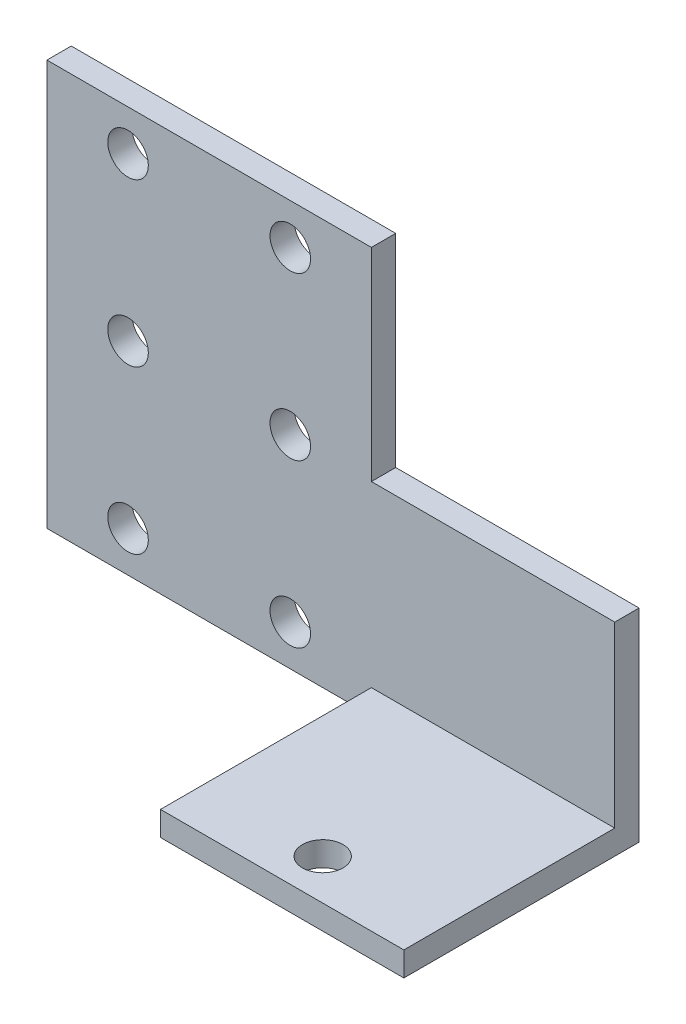
ISO-10303-21;
HEADER;
FILE_DESCRIPTION(('STEP AP214'),'2;1');
FILE_NAME('part.step','',(''),(''),'','','');
FILE_SCHEMA(('AUTOMOTIVE_DESIGN { 1 0 10303 214 1 1 1 1 }'));
ENDSEC;
DATA;
#1=APPLICATION_CONTEXT('core data for automotive mechanical design processes');
#2=APPLICATION_PROTOCOL_DEFINITION('international standard','automotive_design',2000,#1);
#3=PRODUCT_CONTEXT('',#1,'mechanical');
#4=PRODUCT('Part','Part','',(#3));
#5=PRODUCT_RELATED_PRODUCT_CATEGORY('part','',(#4));
#6=PRODUCT_DEFINITION_FORMATION('','',#4);
#7=PRODUCT_DEFINITION_CONTEXT('part definition',#1,'design');
#8=PRODUCT_DEFINITION('design','',#6,#7);
#9=PRODUCT_DEFINITION_SHAPE('','',#8);
#10=(LENGTH_UNIT() NAMED_UNIT(*) SI_UNIT(.MILLI.,.METRE.));
#11=(NAMED_UNIT(*) PLANE_ANGLE_UNIT() SI_UNIT($,.RADIAN.));
#12=(NAMED_UNIT(*) SI_UNIT($,.STERADIAN.) SOLID_ANGLE_UNIT());
#13=UNCERTAINTY_MEASURE_WITH_UNIT(LENGTH_MEASURE(1.E-05),#10,'distance_accuracy_value','');
#14=(GEOMETRIC_REPRESENTATION_CONTEXT(3) GLOBAL_UNCERTAINTY_ASSIGNED_CONTEXT((#13)) GLOBAL_UNIT_ASSIGNED_CONTEXT((#10,
#11,#12)) REPRESENTATION_CONTEXT('',''));
#15=CARTESIAN_POINT('',(0.,0.,0.));
#16=DIRECTION('',(0.,0.,1.));
#17=DIRECTION('',(1.,0.,0.));
#18=AXIS2_PLACEMENT_3D('',#15,#16,#17);
#19=CARTESIAN_POINT('',(40.,0.,3.));
#20=DIRECTION('',(-1.,0.,0.));
#21=DIRECTION('',(0.,-1.,0.));
#22=AXIS2_PLACEMENT_3D('',#19,#20,#21);
#23=PLANE('',#22);
#24=DIRECTION('',(0.,0.,1.));
#25=VECTOR('',#24,1.);
#26=CARTESIAN_POINT('',(40.,25.,2.99999999999999));
#27=LINE('',#26,#25);
#28=CARTESIAN_POINT('',(40.,25.,0.));
#29=VERTEX_POINT('',#28);
#30=CARTESIAN_POINT('',(40.,25.,2.99999999999999));
#31=VERTEX_POINT('',#30);
#32=EDGE_CURVE('E60',#29,#31,#27,.T.);
#33=ORIENTED_EDGE('',*,*,#32,.F.);
#34=DIRECTION('',(0.,1.,0.));
#35=VECTOR('',#34,1.);
#36=CARTESIAN_POINT('',(40.,0.,0.));
#37=LINE('',#36,#35);
#38=CARTESIAN_POINT('',(40.,50.,0.));
#39=VERTEX_POINT('',#38);
#40=EDGE_CURVE('E133',#29,#39,#37,.T.);
#41=ORIENTED_EDGE('',*,*,#40,.T.);
#42=DIRECTION('',(0.,0.,-1.));
#43=VECTOR('',#42,1.);
#44=CARTESIAN_POINT('',(40.,50.,3.));
#45=LINE('',#44,#43);
#46=CARTESIAN_POINT('',(40.,50.,3.));
#47=VERTEX_POINT('',#46);
#48=EDGE_CURVE('E45',#47,#39,#45,.T.);
#49=ORIENTED_EDGE('',*,*,#48,.F.);
#50=DIRECTION('',(0.,1.,0.));
#51=VECTOR('',#50,1.);
#52=CARTESIAN_POINT('',(40.,0.,3.));
#53=LINE('',#52,#51);
#54=EDGE_CURVE('E182',#31,#47,#53,.T.);
#55=ORIENTED_EDGE('',*,*,#54,.F.);
#56=EDGE_LOOP('',(#33,#41,#49,#55));
#57=FACE_BOUND('',#56,.T.);
#58=ADVANCED_FACE('F37',(#57),#23,.F.);
#59=CARTESIAN_POINT('',(0.,0.,3.));
#60=DIRECTION('',(0.,0.,-1.));
#61=DIRECTION('',(-1.,0.,0.));
#62=AXIS2_PLACEMENT_3D('',#59,#60,#61);
#63=PLANE('',#62);
#64=DIRECTION('',(0.,-1.,0.));
#65=VECTOR('',#64,1.);
#66=CARTESIAN_POINT('',(0.,0.,3.));
#67=LINE('',#66,#65);
#68=CARTESIAN_POINT('',(0.,50.,3.));
#69=VERTEX_POINT('',#68);
#70=CARTESIAN_POINT('',(0.,0.,3.));
#71=VERTEX_POINT('',#70);
#72=EDGE_CURVE('E176',#69,#71,#67,.T.);
#73=ORIENTED_EDGE('',*,*,#72,.T.);
#74=DIRECTION('',(1.,0.,0.));
#75=VECTOR('',#74,1.);
#76=CARTESIAN_POINT('',(0.,0.,3.));
#77=LINE('',#76,#75);
#78=CARTESIAN_POINT('',(40.,0.,3.));
#79=VERTEX_POINT('',#78);
#80=EDGE_CURVE('E179',#71,#79,#77,.T.);
#81=ORIENTED_EDGE('',*,*,#80,.T.);
#82=CARTESIAN_POINT('',(40.,3.00000000000001,3.));
#83=VERTEX_POINT('',#82);
#84=EDGE_CURVE('E52',#79,#83,#53,.T.);
#85=ORIENTED_EDGE('',*,*,#84,.T.);
#86=DIRECTION('',(-1.,0.,0.));
#87=VECTOR('',#86,1.);
#88=CARTESIAN_POINT('',(70.,3.00000000000002,3.));
#89=LINE('',#88,#87);
#90=CARTESIAN_POINT('',(70.,3.00000000000002,3.));
#91=VERTEX_POINT('',#90);
#92=EDGE_CURVE('E139',#91,#83,#89,.T.);
#93=ORIENTED_EDGE('',*,*,#92,.F.);
#94=DIRECTION('',(0.,-1.,0.));
#95=VECTOR('',#94,1.);
#96=CARTESIAN_POINT('',(70.,25.,2.99999999999999));
#97=LINE('',#96,#95);
#98=CARTESIAN_POINT('',(70.,25.,2.99999999999999));
#99=VERTEX_POINT('',#98);
#100=EDGE_CURVE('E118',#99,#91,#97,.T.);
#101=ORIENTED_EDGE('',*,*,#100,.F.);
#102=DIRECTION('',(-1.,0.,0.));
#103=VECTOR('',#102,1.);
#104=CARTESIAN_POINT('',(70.,25.,2.99999999999999));
#105=LINE('',#104,#103);
#106=EDGE_CURVE('E115',#99,#31,#105,.T.);
#107=ORIENTED_EDGE('',*,*,#106,.T.);
#108=ORIENTED_EDGE('',*,*,#54,.T.);
#109=DIRECTION('',(-1.,0.,0.));
#110=VECTOR('',#109,1.);
#111=CARTESIAN_POINT('',(0.,50.,3.));
#112=LINE('',#111,#110);
#113=EDGE_CURVE('E184',#47,#69,#112,.T.);
#114=ORIENTED_EDGE('',*,*,#113,.T.);
#115=EDGE_LOOP('',(#73,#81,#85,#93,#101,#107,#108,#114));
#116=FACE_BOUND('',#115,.T.);
#117=CARTESIAN_POINT('',(29.9999999999999,45.,3.));
#118=DIRECTION('',(0.,0.,1.));
#119=DIRECTION('',(1.,0.,0.));
#120=AXIS2_PLACEMENT_3D('',#117,#118,#119);
#121=CIRCLE('',#120,2.5);
#122=CARTESIAN_POINT('',(32.4999999999999,45.,3.));
#123=VERTEX_POINT('',#122);
#124=EDGE_CURVE('E170',#123,#123,#121,.T.);
#125=ORIENTED_EDGE('',*,*,#124,.F.);
#126=EDGE_LOOP('',(#125));
#127=FACE_BOUND('',#126,.T.);
#128=CARTESIAN_POINT('',(9.9999999999999,44.9999999999999,3.));
#129=DIRECTION('',(0.,0.,1.));
#130=DIRECTION('',(1.,0.,0.));
#131=AXIS2_PLACEMENT_3D('',#128,#129,#130);
#132=CIRCLE('',#131,2.5);
#133=CARTESIAN_POINT('',(12.4999999999999,44.9999999999999,3.));
#134=VERTEX_POINT('',#133);
#135=EDGE_CURVE('E164',#134,#134,#132,.T.);
#136=ORIENTED_EDGE('',*,*,#135,.F.);
#137=EDGE_LOOP('',(#136));
#138=FACE_BOUND('',#137,.T.);
#139=CARTESIAN_POINT('',(9.99999999999999,24.9999999999999,3.));
#140=DIRECTION('',(0.,0.,1.));
#141=DIRECTION('',(1.,0.,0.));
#142=AXIS2_PLACEMENT_3D('',#139,#140,#141);
#143=CIRCLE('',#142,2.5);
#144=CARTESIAN_POINT('',(12.5,24.9999999999999,3.));
#145=VERTEX_POINT('',#144);
#146=EDGE_CURVE('E158',#145,#145,#143,.T.);
#147=ORIENTED_EDGE('',*,*,#146,.F.);
#148=EDGE_LOOP('',(#147));
#149=FACE_BOUND('',#148,.T.);
#150=CARTESIAN_POINT('',(9.99999999999999,4.99999999999985,3.));
#151=DIRECTION('',(0.,0.,1.));
#152=DIRECTION('',(1.,0.,0.));
#153=AXIS2_PLACEMENT_3D('',#150,#151,#152);
#154=CIRCLE('',#153,2.5);
#155=CARTESIAN_POINT('',(12.5,4.99999999999985,3.));
#156=VERTEX_POINT('',#155);
#157=EDGE_CURVE('E152',#156,#156,#154,.T.);
#158=ORIENTED_EDGE('',*,*,#157,.F.);
#159=EDGE_LOOP('',(#158));
#160=FACE_BOUND('',#159,.T.);
#161=CARTESIAN_POINT('',(30.,25.,3.));
#162=DIRECTION('',(0.,0.,1.));
#163=DIRECTION('',(1.,0.,0.));
#164=AXIS2_PLACEMENT_3D('',#161,#162,#163);
#165=CIRCLE('',#164,2.50000000000001);
#166=CARTESIAN_POINT('',(32.5,25.,3.));
#167=VERTEX_POINT('',#166);
#168=EDGE_CURVE('E146',#167,#167,#165,.T.);
#169=ORIENTED_EDGE('',*,*,#168,.F.);
#170=EDGE_LOOP('',(#169));
#171=FACE_BOUND('',#170,.T.);
#172=CARTESIAN_POINT('',(30.,5.,3.));
#173=DIRECTION('',(0.,0.,1.));
#174=DIRECTION('',(1.,0.,0.));
#175=AXIS2_PLACEMENT_3D('',#172,#173,#174);
#176=CIRCLE('',#175,2.50000000000001);
#177=CARTESIAN_POINT('',(32.5,5.,3.));
#178=VERTEX_POINT('',#177);
#179=EDGE_CURVE('E137',#178,#178,#176,.T.);
#180=ORIENTED_EDGE('',*,*,#179,.F.);
#181=EDGE_LOOP('',(#180));
#182=FACE_BOUND('',#181,.T.);
#183=ADVANCED_FACE('F203',(#116,#127,#138,#149,#160,#171,#182),#63,.F.);
#184=CARTESIAN_POINT('',(0.,0.,0.));
#185=DIRECTION('',(0.,0.,-1.));
#186=DIRECTION('',(-1.,0.,0.));
#187=AXIS2_PLACEMENT_3D('',#184,#185,#186);
#188=PLANE('',#187);
#189=CARTESIAN_POINT('',(30.,25.,0.));
#190=DIRECTION('',(0.,0.,1.));
#191=DIRECTION('',(1.,0.,0.));
#192=AXIS2_PLACEMENT_3D('',#189,#190,#191);
#193=CIRCLE('',#192,2.50000000000001);
#194=CARTESIAN_POINT('',(32.5,25.,0.));
#195=VERTEX_POINT('',#194);
#196=EDGE_CURVE('E144',#195,#195,#193,.T.);
#197=ORIENTED_EDGE('',*,*,#196,.T.);
#198=EDGE_LOOP('',(#197));
#199=FACE_BOUND('',#198,.T.);
#200=CARTESIAN_POINT('',(9.99999999999999,24.9999999999999,0.));
#201=DIRECTION('',(0.,0.,1.));
#202=DIRECTION('',(1.,0.,0.));
#203=AXIS2_PLACEMENT_3D('',#200,#201,#202);
#204=CIRCLE('',#203,2.5);
#205=CARTESIAN_POINT('',(12.5,24.9999999999999,0.));
#206=VERTEX_POINT('',#205);
#207=EDGE_CURVE('E155',#206,#206,#204,.T.);
#208=ORIENTED_EDGE('',*,*,#207,.T.);
#209=EDGE_LOOP('',(#208));
#210=FACE_BOUND('',#209,.T.);
#211=CARTESIAN_POINT('',(29.9999999999999,45.,0.));
#212=DIRECTION('',(0.,0.,1.));
#213=DIRECTION('',(1.,0.,0.));
#214=AXIS2_PLACEMENT_3D('',#211,#212,#213);
#215=CIRCLE('',#214,2.5);
#216=CARTESIAN_POINT('',(32.4999999999999,45.,0.));
#217=VERTEX_POINT('',#216);
#218=EDGE_CURVE('E167',#217,#217,#215,.T.);
#219=ORIENTED_EDGE('',*,*,#218,.T.);
#220=EDGE_LOOP('',(#219));
#221=FACE_BOUND('',#220,.T.);
#222=DIRECTION('',(0.,-1.,0.));
#223=VECTOR('',#222,1.);
#224=CARTESIAN_POINT('',(0.,0.,0.));
#225=LINE('',#224,#223);
#226=CARTESIAN_POINT('',(0.,50.,0.));
#227=VERTEX_POINT('',#226);
#228=CARTESIAN_POINT('',(0.,0.,0.));
#229=VERTEX_POINT('',#228);
#230=EDGE_CURVE('E173',#227,#229,#225,.T.);
#231=ORIENTED_EDGE('',*,*,#230,.F.);
#232=DIRECTION('',(-1.,0.,0.));
#233=VECTOR('',#232,1.);
#234=CARTESIAN_POINT('',(0.,50.,0.));
#235=LINE('',#234,#233);
#236=EDGE_CURVE('E180',#39,#227,#235,.T.);
#237=ORIENTED_EDGE('',*,*,#236,.F.);
#238=ORIENTED_EDGE('',*,*,#40,.F.);
#239=DIRECTION('',(-1.,0.,0.));
#240=VECTOR('',#239,1.);
#241=CARTESIAN_POINT('',(70.,25.,0.));
#242=LINE('',#241,#240);
#243=CARTESIAN_POINT('',(70.,25.,0.));
#244=VERTEX_POINT('',#243);
#245=EDGE_CURVE('E113',#244,#29,#242,.T.);
#246=ORIENTED_EDGE('',*,*,#245,.F.);
#247=DIRECTION('',(0.,1.,0.));
#248=VECTOR('',#247,1.);
#249=CARTESIAN_POINT('',(70.,0.,0.));
#250=LINE('',#249,#248);
#251=CARTESIAN_POINT('',(70.,0.,0.));
#252=VERTEX_POINT('',#251);
#253=EDGE_CURVE('E119',#252,#244,#250,.T.);
#254=ORIENTED_EDGE('',*,*,#253,.F.);
#255=DIRECTION('',(1.,0.,0.));
#256=VECTOR('',#255,1.);
#257=CARTESIAN_POINT('',(0.,0.,0.));
#258=LINE('',#257,#256);
#259=EDGE_CURVE('E189',#229,#252,#258,.T.);
#260=ORIENTED_EDGE('',*,*,#259,.F.);
#261=EDGE_LOOP('',(#231,#237,#238,#246,#254,#260));
#262=FACE_BOUND('',#261,.T.);
#263=CARTESIAN_POINT('',(9.9999999999999,44.9999999999999,0.));
#264=DIRECTION('',(0.,0.,1.));
#265=DIRECTION('',(1.,0.,0.));
#266=AXIS2_PLACEMENT_3D('',#263,#264,#265);
#267=CIRCLE('',#266,2.5);
#268=CARTESIAN_POINT('',(12.4999999999999,44.9999999999999,0.));
#269=VERTEX_POINT('',#268);
#270=EDGE_CURVE('E161',#269,#269,#267,.T.);
#271=ORIENTED_EDGE('',*,*,#270,.T.);
#272=EDGE_LOOP('',(#271));
#273=FACE_BOUND('',#272,.T.);
#274=CARTESIAN_POINT('',(9.99999999999999,4.99999999999985,0.));
#275=DIRECTION('',(0.,0.,1.));
#276=DIRECTION('',(1.,0.,0.));
#277=AXIS2_PLACEMENT_3D('',#274,#275,#276);
#278=CIRCLE('',#277,2.5);
#279=CARTESIAN_POINT('',(12.5,4.99999999999985,0.));
#280=VERTEX_POINT('',#279);
#281=EDGE_CURVE('E149',#280,#280,#278,.T.);
#282=ORIENTED_EDGE('',*,*,#281,.T.);
#283=EDGE_LOOP('',(#282));
#284=FACE_BOUND('',#283,.T.);
#285=CARTESIAN_POINT('',(30.,5.,0.));
#286=DIRECTION('',(0.,0.,1.));
#287=DIRECTION('',(1.,0.,0.));
#288=AXIS2_PLACEMENT_3D('',#285,#286,#287);
#289=CIRCLE('',#288,2.50000000000001);
#290=CARTESIAN_POINT('',(32.5,5.,0.));
#291=VERTEX_POINT('',#290);
#292=EDGE_CURVE('E134',#291,#291,#289,.T.);
#293=ORIENTED_EDGE('',*,*,#292,.T.);
#294=EDGE_LOOP('',(#293));
#295=FACE_BOUND('',#294,.T.);
#296=ADVANCED_FACE('F130',(#199,#210,#221,#262,#273,#284,#295),#188,.T.);
#297=CARTESIAN_POINT('',(0.,0.,3.));
#298=DIRECTION('',(1.,0.,0.));
#299=DIRECTION('',(0.,0.,-1.));
#300=AXIS2_PLACEMENT_3D('',#297,#298,#299);
#301=PLANE('',#300);
#302=ORIENTED_EDGE('',*,*,#230,.T.);
#303=DIRECTION('',(0.,0.,-1.));
#304=VECTOR('',#303,1.);
#305=CARTESIAN_POINT('',(0.,0.,3.));
#306=LINE('',#305,#304);
#307=EDGE_CURVE('E11',#71,#229,#306,.T.);
#308=ORIENTED_EDGE('',*,*,#307,.F.);
#309=ORIENTED_EDGE('',*,*,#72,.F.);
#310=DIRECTION('',(0.,0.,-1.));
#311=VECTOR('',#310,1.);
#312=CARTESIAN_POINT('',(0.,50.,3.));
#313=LINE('',#312,#311);
#314=EDGE_CURVE('E186',#69,#227,#313,.T.);
#315=ORIENTED_EDGE('',*,*,#314,.T.);
#316=EDGE_LOOP('',(#302,#308,#309,#315));
#317=FACE_BOUND('',#316,.T.);
#318=ADVANCED_FACE('F39',(#317),#301,.F.);
#319=CARTESIAN_POINT('',(0.,0.,3.));
#320=DIRECTION('',(0.,1.,0.));
#321=DIRECTION('',(-1.,0.,0.));
#322=AXIS2_PLACEMENT_3D('',#319,#320,#321);
#323=PLANE('',#322);
#324=CARTESIAN_POINT('',(55.,0.,24.));
#325=DIRECTION('',(0.,1.,0.));
#326=DIRECTION('',(-1.,0.,0.));
#327=AXIS2_PLACEMENT_3D('',#324,#325,#326);
#328=CIRCLE('',#327,2.5);
#329=CARTESIAN_POINT('',(52.5,0.,24.));
#330=VERTEX_POINT('',#329);
#331=EDGE_CURVE('E206',#330,#330,#328,.T.);
#332=ORIENTED_EDGE('',*,*,#331,.T.);
#333=EDGE_LOOP('',(#332));
#334=FACE_BOUND('',#333,.T.);
#335=ORIENTED_EDGE('',*,*,#259,.T.);
#336=DIRECTION('',(0.,0.,-1.));
#337=VECTOR('',#336,1.);
#338=CARTESIAN_POINT('',(70.,0.,0.));
#339=LINE('',#338,#337);
#340=CARTESIAN_POINT('',(70.,0.,29.));
#341=VERTEX_POINT('',#340);
#342=EDGE_CURVE('E125',#341,#252,#339,.T.);
#343=ORIENTED_EDGE('',*,*,#342,.F.);
#344=DIRECTION('',(-1.,0.,0.));
#345=VECTOR('',#344,1.);
#346=CARTESIAN_POINT('',(70.,0.,29.));
#347=LINE('',#346,#345);
#348=CARTESIAN_POINT('',(40.,0.,29.));
#349=VERTEX_POINT('',#348);
#350=EDGE_CURVE('E219',#341,#349,#347,.T.);
#351=ORIENTED_EDGE('',*,*,#350,.T.);
#352=DIRECTION('',(0.,0.,-1.));
#353=VECTOR('',#352,1.);
#354=CARTESIAN_POINT('',(40.,0.,0.));
#355=LINE('',#354,#353);
#356=EDGE_CURVE('E127',#349,#79,#355,.T.);
#357=ORIENTED_EDGE('',*,*,#356,.T.);
#358=ORIENTED_EDGE('',*,*,#80,.F.);
#359=ORIENTED_EDGE('',*,*,#307,.T.);
#360=EDGE_LOOP('',(#335,#343,#351,#357,#358,#359));
#361=FACE_BOUND('',#360,.T.);
#362=ADVANCED_FACE('F239',(#334,#361),#323,.F.);
#363=CARTESIAN_POINT('',(0.,50.,3.));
#364=DIRECTION('',(0.,-1.,0.));
#365=DIRECTION('',(1.,0.,0.));
#366=AXIS2_PLACEMENT_3D('',#363,#364,#365);
#367=PLANE('',#366);
#368=ORIENTED_EDGE('',*,*,#236,.T.);
#369=ORIENTED_EDGE('',*,*,#314,.F.);
#370=ORIENTED_EDGE('',*,*,#113,.F.);
#371=ORIENTED_EDGE('',*,*,#48,.T.);
#372=EDGE_LOOP('',(#368,#369,#370,#371));
#373=FACE_BOUND('',#372,.T.);
#374=ADVANCED_FACE('F198',(#373),#367,.F.);
#375=CARTESIAN_POINT('',(29.9999999999999,45.,3.));
#376=DIRECTION('',(0.,0.,-1.));
#377=DIRECTION('',(-1.,0.,0.));
#378=AXIS2_PLACEMENT_3D('',#375,#376,#377);
#379=CYLINDRICAL_SURFACE('',#378,2.5);
#380=ORIENTED_EDGE('',*,*,#124,.T.);
#381=EDGE_LOOP('',(#380));
#382=FACE_BOUND('',#381,.T.);
#383=ORIENTED_EDGE('',*,*,#218,.F.);
#384=EDGE_LOOP('',(#383));
#385=FACE_BOUND('',#384,.T.);
#386=ADVANCED_FACE('F271',(#382,#385),#379,.F.);
#387=CARTESIAN_POINT('',(9.9999999999999,44.9999999999999,3.));
#388=DIRECTION('',(0.,0.,-1.));
#389=DIRECTION('',(-1.,0.,0.));
#390=AXIS2_PLACEMENT_3D('',#387,#388,#389);
#391=CYLINDRICAL_SURFACE('',#390,2.5);
#392=ORIENTED_EDGE('',*,*,#135,.T.);
#393=EDGE_LOOP('',(#392));
#394=FACE_BOUND('',#393,.T.);
#395=ORIENTED_EDGE('',*,*,#270,.F.);
#396=EDGE_LOOP('',(#395));
#397=FACE_BOUND('',#396,.T.);
#398=ADVANCED_FACE('F303',(#394,#397),#391,.F.);
#399=CARTESIAN_POINT('',(9.99999999999999,24.9999999999999,3.));
#400=DIRECTION('',(0.,0.,-1.));
#401=DIRECTION('',(-1.,0.,0.));
#402=AXIS2_PLACEMENT_3D('',#399,#400,#401);
#403=CYLINDRICAL_SURFACE('',#402,2.5);
#404=ORIENTED_EDGE('',*,*,#146,.T.);
#405=EDGE_LOOP('',(#404));
#406=FACE_BOUND('',#405,.T.);
#407=ORIENTED_EDGE('',*,*,#207,.F.);
#408=EDGE_LOOP('',(#407));
#409=FACE_BOUND('',#408,.T.);
#410=ADVANCED_FACE('F299',(#406,#409),#403,.F.);
#411=CARTESIAN_POINT('',(9.99999999999999,4.99999999999985,3.));
#412=DIRECTION('',(0.,0.,-1.));
#413=DIRECTION('',(-1.,0.,0.));
#414=AXIS2_PLACEMENT_3D('',#411,#412,#413);
#415=CYLINDRICAL_SURFACE('',#414,2.5);
#416=ORIENTED_EDGE('',*,*,#157,.T.);
#417=EDGE_LOOP('',(#416));
#418=FACE_BOUND('',#417,.T.);
#419=ORIENTED_EDGE('',*,*,#281,.F.);
#420=EDGE_LOOP('',(#419));
#421=FACE_BOUND('',#420,.T.);
#422=ADVANCED_FACE('F292',(#418,#421),#415,.F.);
#423=CARTESIAN_POINT('',(30.,25.,3.));
#424=DIRECTION('',(0.,0.,-1.));
#425=DIRECTION('',(-1.,0.,0.));
#426=AXIS2_PLACEMENT_3D('',#423,#424,#425);
#427=CYLINDRICAL_SURFACE('',#426,2.50000000000001);
#428=ORIENTED_EDGE('',*,*,#168,.T.);
#429=EDGE_LOOP('',(#428));
#430=FACE_BOUND('',#429,.T.);
#431=ORIENTED_EDGE('',*,*,#196,.F.);
#432=EDGE_LOOP('',(#431));
#433=FACE_BOUND('',#432,.T.);
#434=ADVANCED_FACE('F286',(#430,#433),#427,.F.);
#435=CARTESIAN_POINT('',(30.,5.,3.));
#436=DIRECTION('',(0.,0.,-1.));
#437=DIRECTION('',(-1.,0.,0.));
#438=AXIS2_PLACEMENT_3D('',#435,#436,#437);
#439=CYLINDRICAL_SURFACE('',#438,2.50000000000001);
#440=ORIENTED_EDGE('',*,*,#179,.T.);
#441=EDGE_LOOP('',(#440));
#442=FACE_BOUND('',#441,.T.);
#443=ORIENTED_EDGE('',*,*,#292,.F.);
#444=EDGE_LOOP('',(#443));
#445=FACE_BOUND('',#444,.T.);
#446=ADVANCED_FACE('F282',(#442,#445),#439,.F.);
#447=CARTESIAN_POINT('',(40.,0.,0.));
#448=DIRECTION('',(-1.,0.,0.));
#449=DIRECTION('',(0.,-1.,0.));
#450=AXIS2_PLACEMENT_3D('',#447,#448,#449);
#451=PLANE('',#450);
#452=ORIENTED_EDGE('',*,*,#84,.F.);
#453=ORIENTED_EDGE('',*,*,#356,.F.);
#454=DIRECTION('',(0.,-1.,0.));
#455=VECTOR('',#454,1.);
#456=CARTESIAN_POINT('',(40.,0.,29.));
#457=LINE('',#456,#455);
#458=CARTESIAN_POINT('',(40.,3.00000000000001,29.));
#459=VERTEX_POINT('',#458);
#460=EDGE_CURVE('E208',#459,#349,#457,.T.);
#461=ORIENTED_EDGE('',*,*,#460,.F.);
#462=DIRECTION('',(0.,0.,1.));
#463=VECTOR('',#462,1.);
#464=CARTESIAN_POINT('',(40.,3.00000000000001,29.));
#465=LINE('',#464,#463);
#466=EDGE_CURVE('E205',#83,#459,#465,.T.);
#467=ORIENTED_EDGE('',*,*,#466,.F.);
#468=EDGE_LOOP('',(#452,#453,#461,#467));
#469=FACE_BOUND('',#468,.T.);
#470=ADVANCED_FACE('F232',(#469),#451,.T.);
#471=CARTESIAN_POINT('',(70.,25.,2.99999999999999));
#472=DIRECTION('',(0.,-1.,0.));
#473=DIRECTION('',(1.,0.,0.));
#474=AXIS2_PLACEMENT_3D('',#471,#472,#473);
#475=PLANE('',#474);
#476=ORIENTED_EDGE('',*,*,#32,.T.);
#477=ORIENTED_EDGE('',*,*,#106,.F.);
#478=DIRECTION('',(0.,0.,1.));
#479=VECTOR('',#478,1.);
#480=CARTESIAN_POINT('',(70.,25.,2.99999999999999));
#481=LINE('',#480,#479);
#482=EDGE_CURVE('E109',#244,#99,#481,.T.);
#483=ORIENTED_EDGE('',*,*,#482,.F.);
#484=ORIENTED_EDGE('',*,*,#245,.T.);
#485=EDGE_LOOP('',(#476,#477,#483,#484));
#486=FACE_BOUND('',#485,.T.);
#487=ADVANCED_FACE('F111',(#486),#475,.F.);
#488=CARTESIAN_POINT('',(70.,3.00000000000002,29.));
#489=DIRECTION('',(0.,-1.,0.));
#490=DIRECTION('',(1.,0.,0.));
#491=AXIS2_PLACEMENT_3D('',#488,#489,#490);
#492=PLANE('',#491);
#493=CARTESIAN_POINT('',(55.,3.00000000000001,24.));
#494=DIRECTION('',(0.,1.,0.));
#495=DIRECTION('',(-1.,0.,0.));
#496=AXIS2_PLACEMENT_3D('',#493,#494,#495);
#497=CIRCLE('',#496,2.5);
#498=CARTESIAN_POINT('',(52.5,3.00000000000001,24.));
#499=VERTEX_POINT('',#498);
#500=EDGE_CURVE('E211',#499,#499,#497,.T.);
#501=ORIENTED_EDGE('',*,*,#500,.F.);
#502=EDGE_LOOP('',(#501));
#503=FACE_BOUND('',#502,.T.);
#504=ORIENTED_EDGE('',*,*,#466,.T.);
#505=DIRECTION('',(-1.,0.,0.));
#506=VECTOR('',#505,1.);
#507=CARTESIAN_POINT('',(70.,3.00000000000002,29.));
#508=LINE('',#507,#506);
#509=CARTESIAN_POINT('',(70.,3.00000000000002,29.));
#510=VERTEX_POINT('',#509);
#511=EDGE_CURVE('E222',#510,#459,#508,.T.);
#512=ORIENTED_EDGE('',*,*,#511,.F.);
#513=DIRECTION('',(0.,0.,1.));
#514=VECTOR('',#513,1.);
#515=CARTESIAN_POINT('',(70.,3.00000000000002,29.));
#516=LINE('',#515,#514);
#517=EDGE_CURVE('E229',#91,#510,#516,.T.);
#518=ORIENTED_EDGE('',*,*,#517,.F.);
#519=ORIENTED_EDGE('',*,*,#92,.T.);
#520=EDGE_LOOP('',(#504,#512,#518,#519));
#521=FACE_BOUND('',#520,.T.);
#522=ADVANCED_FACE('F227',(#503,#521),#492,.F.);
#523=CARTESIAN_POINT('',(70.,0.,29.));
#524=DIRECTION('',(0.,0.,-1.));
#525=DIRECTION('',(0.,1.,0.));
#526=AXIS2_PLACEMENT_3D('',#523,#524,#525);
#527=PLANE('',#526);
#528=ORIENTED_EDGE('',*,*,#460,.T.);
#529=ORIENTED_EDGE('',*,*,#350,.F.);
#530=DIRECTION('',(0.,-1.,0.));
#531=VECTOR('',#530,1.);
#532=CARTESIAN_POINT('',(70.,0.,29.));
#533=LINE('',#532,#531);
#534=EDGE_CURVE('E240',#510,#341,#533,.T.);
#535=ORIENTED_EDGE('',*,*,#534,.F.);
#536=ORIENTED_EDGE('',*,*,#511,.T.);
#537=EDGE_LOOP('',(#528,#529,#535,#536));
#538=FACE_BOUND('',#537,.T.);
#539=ADVANCED_FACE('F236',(#538),#527,.F.);
#540=CARTESIAN_POINT('',(70.,0.,0.));
#541=DIRECTION('',(-1.,0.,0.));
#542=DIRECTION('',(0.,-1.,0.));
#543=AXIS2_PLACEMENT_3D('',#540,#541,#542);
#544=PLANE('',#543);
#545=ORIENTED_EDGE('',*,*,#253,.T.);
#546=ORIENTED_EDGE('',*,*,#482,.T.);
#547=ORIENTED_EDGE('',*,*,#100,.T.);
#548=ORIENTED_EDGE('',*,*,#517,.T.);
#549=ORIENTED_EDGE('',*,*,#534,.T.);
#550=ORIENTED_EDGE('',*,*,#342,.T.);
#551=EDGE_LOOP('',(#545,#546,#547,#548,#549,#550));
#552=FACE_BOUND('',#551,.T.);
#553=ADVANCED_FACE('F123',(#552),#544,.F.);
#554=CARTESIAN_POINT('',(55.,0.,24.));
#555=DIRECTION('',(0.,1.,0.));
#556=DIRECTION('',(-1.,0.,0.));
#557=AXIS2_PLACEMENT_3D('',#554,#555,#556);
#558=CYLINDRICAL_SURFACE('',#557,2.5);
#559=ORIENTED_EDGE('',*,*,#331,.F.);
#560=EDGE_LOOP('',(#559));
#561=FACE_BOUND('',#560,.T.);
#562=ORIENTED_EDGE('',*,*,#500,.T.);
#563=EDGE_LOOP('',(#562));
#564=FACE_BOUND('',#563,.T.);
#565=ADVANCED_FACE('F247',(#561,#564),#558,.F.);
#566=CLOSED_SHELL('',(#58,#183,#296,#318,#362,#374,#386,#398,#410,#422,#434,#446,#470,#487,#522,
#539,#553,#565));
#567=MANIFOLD_SOLID_BREP('B2',#566);
#568=ADVANCED_BREP_SHAPE_REPRESENTATION('',(#18,#567),#14);
#569=SHAPE_DEFINITION_REPRESENTATION(#9,#568);
ENDSEC;
END-ISO-10303-21;
